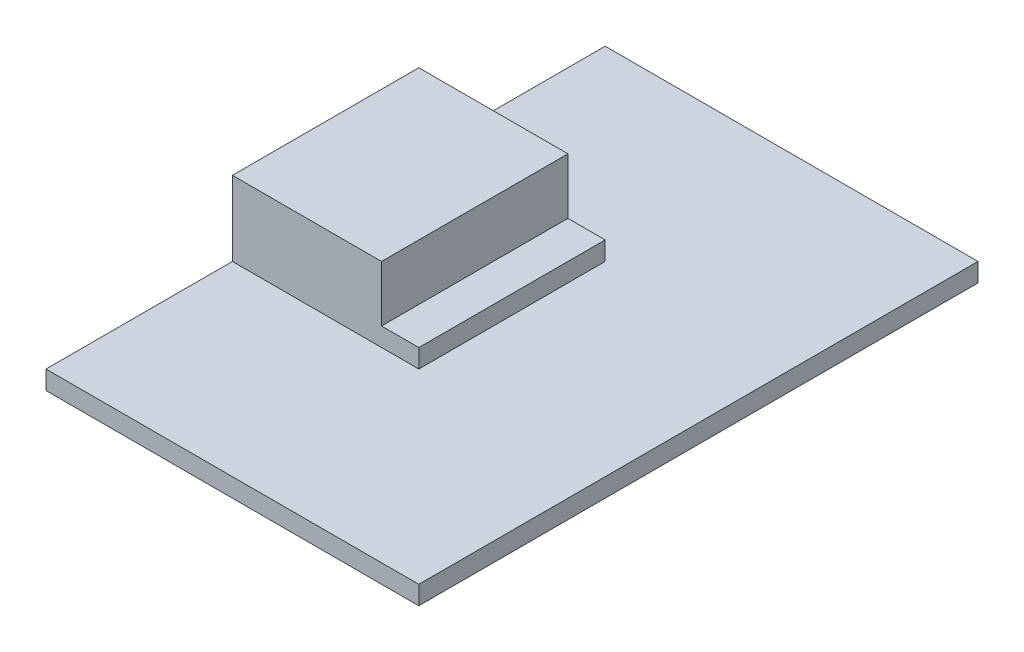
ISO-10303-21;
HEADER;
FILE_DESCRIPTION(('STEP AP214'),'2;1');
FILE_NAME('part.step','',(''),(''),'','','');
FILE_SCHEMA(('AUTOMOTIVE_DESIGN { 1 0 10303 214 1 1 1 1 }'));
ENDSEC;
DATA;
#1=APPLICATION_CONTEXT('core data for automotive mechanical design processes');
#2=APPLICATION_PROTOCOL_DEFINITION('international standard','automotive_design',2000,#1);
#3=PRODUCT_CONTEXT('',#1,'mechanical');
#4=PRODUCT('Part','Part','',(#3));
#5=PRODUCT_RELATED_PRODUCT_CATEGORY('part','',(#4));
#6=PRODUCT_DEFINITION_FORMATION('','',#4);
#7=PRODUCT_DEFINITION_CONTEXT('part definition',#1,'design');
#8=PRODUCT_DEFINITION('design','',#6,#7);
#9=PRODUCT_DEFINITION_SHAPE('','',#8);
#10=(LENGTH_UNIT() NAMED_UNIT(*) SI_UNIT(.MILLI.,.METRE.));
#11=(NAMED_UNIT(*) PLANE_ANGLE_UNIT() SI_UNIT($,.RADIAN.));
#12=(NAMED_UNIT(*) SI_UNIT($,.STERADIAN.) SOLID_ANGLE_UNIT());
#13=UNCERTAINTY_MEASURE_WITH_UNIT(LENGTH_MEASURE(1.E-05),#10,'distance_accuracy_value','');
#14=(GEOMETRIC_REPRESENTATION_CONTEXT(3) GLOBAL_UNCERTAINTY_ASSIGNED_CONTEXT((#13)) GLOBAL_UNIT_ASSIGNED_CONTEXT((#10,
#11,#12)) REPRESENTATION_CONTEXT('',''));
#15=CARTESIAN_POINT('',(0.,0.,0.));
#16=DIRECTION('',(0.,0.,1.));
#17=DIRECTION('',(1.,0.,0.));
#18=AXIS2_PLACEMENT_3D('',#15,#16,#17);
#19=CARTESIAN_POINT('',(4.,5.,5.));
#20=DIRECTION('',(0.,0.,-1.));
#21=DIRECTION('',(-1.,0.,0.));
#22=AXIS2_PLACEMENT_3D('',#19,#20,#21);
#23=PLANE('',#22);
#24=DIRECTION('',(-1.,0.,0.));
#25=VECTOR('',#24,1.);
#26=CARTESIAN_POINT('',(4.,1.,5.));
#27=LINE('',#26,#25);
#28=CARTESIAN_POINT('',(6.,1.,5.));
#29=VERTEX_POINT('',#28);
#30=CARTESIAN_POINT('',(-4.,1.,5.));
#31=VERTEX_POINT('',#30);
#32=EDGE_CURVE('E156',#29,#31,#27,.T.);
#33=ORIENTED_EDGE('',*,*,#32,.F.);
#34=DIRECTION('',(0.,-1.,0.));
#35=VECTOR('',#34,1.);
#36=CARTESIAN_POINT('',(6.,0.,5.));
#37=LINE('',#36,#35);
#38=CARTESIAN_POINT('',(6.,2.,5.));
#39=VERTEX_POINT('',#38);
#40=EDGE_CURVE('E159',#39,#29,#37,.T.);
#41=ORIENTED_EDGE('',*,*,#40,.F.);
#42=DIRECTION('',(-1.,0.,0.));
#43=VECTOR('',#42,1.);
#44=CARTESIAN_POINT('',(6.,2.,5.));
#45=LINE('',#44,#43);
#46=CARTESIAN_POINT('',(4.,2.,5.));
#47=VERTEX_POINT('',#46);
#48=EDGE_CURVE('E166',#39,#47,#45,.T.);
#49=ORIENTED_EDGE('',*,*,#48,.T.);
#50=DIRECTION('',(0.,-1.,0.));
#51=VECTOR('',#50,1.);
#52=CARTESIAN_POINT('',(4.,5.,5.));
#53=LINE('',#52,#51);
#54=CARTESIAN_POINT('',(4.,5.,5.));
#55=VERTEX_POINT('',#54);
#56=EDGE_CURVE('E175',#55,#47,#53,.T.);
#57=ORIENTED_EDGE('',*,*,#56,.F.);
#58=DIRECTION('',(1.,0.,0.));
#59=VECTOR('',#58,1.);
#60=CARTESIAN_POINT('',(4.,5.,5.));
#61=LINE('',#60,#59);
#62=CARTESIAN_POINT('',(-4.,5.,5.));
#63=VERTEX_POINT('',#62);
#64=EDGE_CURVE('E191',#63,#55,#61,.T.);
#65=ORIENTED_EDGE('',*,*,#64,.F.);
#66=DIRECTION('',(0.,-1.,0.));
#67=VECTOR('',#66,1.);
#68=CARTESIAN_POINT('',(-4.,5.,5.));
#69=LINE('',#68,#67);
#70=EDGE_CURVE('E42',#63,#31,#69,.T.);
#71=ORIENTED_EDGE('',*,*,#70,.T.);
#72=EDGE_LOOP('',(#33,#41,#49,#57,#65,#71));
#73=FACE_BOUND('',#72,.T.);
#74=ADVANCED_FACE('F34',(#73),#23,.F.);
#75=CARTESIAN_POINT('',(4.,5.,-5.));
#76=DIRECTION('',(0.,0.,1.));
#77=DIRECTION('',(1.,0.,0.));
#78=AXIS2_PLACEMENT_3D('',#75,#76,#77);
#79=PLANE('',#78);
#80=DIRECTION('',(1.,0.,0.));
#81=VECTOR('',#80,1.);
#82=CARTESIAN_POINT('',(4.,1.,-5.));
#83=LINE('',#82,#81);
#84=CARTESIAN_POINT('',(-4.,1.,-5.));
#85=VERTEX_POINT('',#84);
#86=CARTESIAN_POINT('',(6.,1.,-5.));
#87=VERTEX_POINT('',#86);
#88=EDGE_CURVE('E56',#85,#87,#83,.T.);
#89=ORIENTED_EDGE('',*,*,#88,.F.);
#90=DIRECTION('',(0.,-1.,0.));
#91=VECTOR('',#90,1.);
#92=CARTESIAN_POINT('',(-4.,5.,-5.));
#93=LINE('',#92,#91);
#94=CARTESIAN_POINT('',(-4.,5.,-5.));
#95=VERTEX_POINT('',#94);
#96=EDGE_CURVE('E117',#95,#85,#93,.T.);
#97=ORIENTED_EDGE('',*,*,#96,.F.);
#98=DIRECTION('',(-1.,0.,0.));
#99=VECTOR('',#98,1.);
#100=CARTESIAN_POINT('',(4.,5.,-5.));
#101=LINE('',#100,#99);
#102=CARTESIAN_POINT('',(4.,5.,-5.));
#103=VERTEX_POINT('',#102);
#104=EDGE_CURVE('E194',#103,#95,#101,.T.);
#105=ORIENTED_EDGE('',*,*,#104,.F.);
#106=DIRECTION('',(0.,-1.,0.));
#107=VECTOR('',#106,1.);
#108=CARTESIAN_POINT('',(4.,5.,-5.));
#109=LINE('',#108,#107);
#110=CARTESIAN_POINT('',(4.,2.,-5.));
#111=VERTEX_POINT('',#110);
#112=EDGE_CURVE('E197',#103,#111,#109,.T.);
#113=ORIENTED_EDGE('',*,*,#112,.T.);
#114=DIRECTION('',(-1.,0.,0.));
#115=VECTOR('',#114,1.);
#116=CARTESIAN_POINT('',(6.,2.,-5.));
#117=LINE('',#116,#115);
#118=CARTESIAN_POINT('',(6.,2.,-5.));
#119=VERTEX_POINT('',#118);
#120=EDGE_CURVE('E180',#119,#111,#117,.T.);
#121=ORIENTED_EDGE('',*,*,#120,.F.);
#122=DIRECTION('',(0.,1.,0.));
#123=VECTOR('',#122,1.);
#124=CARTESIAN_POINT('',(6.,0.,-5.));
#125=LINE('',#124,#123);
#126=EDGE_CURVE('E162',#87,#119,#125,.T.);
#127=ORIENTED_EDGE('',*,*,#126,.F.);
#128=EDGE_LOOP('',(#89,#97,#105,#113,#121,#127));
#129=FACE_BOUND('',#128,.T.);
#130=ADVANCED_FACE('F231',(#129),#79,.F.);
#131=CARTESIAN_POINT('',(6.,0.,0.));
#132=DIRECTION('',(-1.,0.,0.));
#133=DIRECTION('',(0.,0.,1.));
#134=AXIS2_PLACEMENT_3D('',#131,#132,#133);
#135=PLANE('',#134);
#136=DIRECTION('',(0.,0.,1.));
#137=VECTOR('',#136,1.);
#138=CARTESIAN_POINT('',(6.,1.,0.));
#139=LINE('',#138,#137);
#140=EDGE_CURVE('E11',#87,#29,#139,.T.);
#141=ORIENTED_EDGE('',*,*,#140,.F.);
#142=ORIENTED_EDGE('',*,*,#126,.T.);
#143=DIRECTION('',(0.,0.,1.));
#144=VECTOR('',#143,1.);
#145=CARTESIAN_POINT('',(6.,2.,5.));
#146=LINE('',#145,#144);
#147=EDGE_CURVE('E164',#119,#39,#146,.T.);
#148=ORIENTED_EDGE('',*,*,#147,.T.);
#149=ORIENTED_EDGE('',*,*,#40,.T.);
#150=EDGE_LOOP('',(#141,#142,#148,#149));
#151=FACE_BOUND('',#150,.T.);
#152=ADVANCED_FACE('F212',(#151),#135,.F.);
#153=CARTESIAN_POINT('',(4.,5.,-5.));
#154=DIRECTION('',(-1.,0.,0.));
#155=DIRECTION('',(0.,0.,1.));
#156=AXIS2_PLACEMENT_3D('',#153,#154,#155);
#157=PLANE('',#156);
#158=DIRECTION('',(0.,0.,1.));
#159=VECTOR('',#158,1.);
#160=CARTESIAN_POINT('',(4.,2.,5.));
#161=LINE('',#160,#159);
#162=EDGE_CURVE('E158',#111,#47,#161,.T.);
#163=ORIENTED_EDGE('',*,*,#162,.F.);
#164=ORIENTED_EDGE('',*,*,#112,.F.);
#165=DIRECTION('',(0.,0.,-1.));
#166=VECTOR('',#165,1.);
#167=CARTESIAN_POINT('',(4.,5.,-5.));
#168=LINE('',#167,#166);
#169=EDGE_CURVE('E207',#55,#103,#168,.T.);
#170=ORIENTED_EDGE('',*,*,#169,.F.);
#171=ORIENTED_EDGE('',*,*,#56,.T.);
#172=EDGE_LOOP('',(#163,#164,#170,#171));
#173=FACE_BOUND('',#172,.T.);
#174=ADVANCED_FACE('F205',(#173),#157,.F.);
#175=CARTESIAN_POINT('',(-4.,5.,-5.));
#176=DIRECTION('',(1.,0.,0.));
#177=DIRECTION('',(0.,0.,-1.));
#178=AXIS2_PLACEMENT_3D('',#175,#176,#177);
#179=PLANE('',#178);
#180=DIRECTION('',(0.,0.,1.));
#181=VECTOR('',#180,1.);
#182=CARTESIAN_POINT('',(-4.,0.,-5.));
#183=LINE('',#182,#181);
#184=CARTESIAN_POINT('',(-4.,0.,-15.));
#185=VERTEX_POINT('',#184);
#186=CARTESIAN_POINT('',(-4.,0.,15.));
#187=VERTEX_POINT('',#186);
#188=EDGE_CURVE('E184',#185,#187,#183,.T.);
#189=ORIENTED_EDGE('',*,*,#188,.T.);
#190=DIRECTION('',(0.,-1.,0.));
#191=VECTOR('',#190,1.);
#192=CARTESIAN_POINT('',(-4.,1.,15.));
#193=LINE('',#192,#191);
#194=CARTESIAN_POINT('',(-4.,1.,15.));
#195=VERTEX_POINT('',#194);
#196=EDGE_CURVE('E149',#195,#187,#193,.T.);
#197=ORIENTED_EDGE('',*,*,#196,.F.);
#198=DIRECTION('',(0.,0.,-1.));
#199=VECTOR('',#198,1.);
#200=CARTESIAN_POINT('',(-4.,1.,15.));
#201=LINE('',#200,#199);
#202=EDGE_CURVE('E120',#195,#31,#201,.T.);
#203=ORIENTED_EDGE('',*,*,#202,.T.);
#204=ORIENTED_EDGE('',*,*,#70,.F.);
#205=DIRECTION('',(0.,0.,1.));
#206=VECTOR('',#205,1.);
#207=CARTESIAN_POINT('',(-4.,5.,-5.));
#208=LINE('',#207,#206);
#209=EDGE_CURVE('E169',#95,#63,#208,.T.);
#210=ORIENTED_EDGE('',*,*,#209,.F.);
#211=ORIENTED_EDGE('',*,*,#96,.T.);
#212=CARTESIAN_POINT('',(-4.,1.,-15.));
#213=VERTEX_POINT('',#212);
#214=EDGE_CURVE('E112',#85,#213,#201,.T.);
#215=ORIENTED_EDGE('',*,*,#214,.T.);
#216=DIRECTION('',(0.,-1.,0.));
#217=VECTOR('',#216,1.);
#218=CARTESIAN_POINT('',(-4.,1.,-15.));
#219=LINE('',#218,#217);
#220=EDGE_CURVE('E114',#213,#185,#219,.T.);
#221=ORIENTED_EDGE('',*,*,#220,.T.);
#222=EDGE_LOOP('',(#189,#197,#203,#204,#210,#211,#215,#221));
#223=FACE_BOUND('',#222,.T.);
#224=ADVANCED_FACE('F36',(#223),#179,.F.);
#225=CARTESIAN_POINT('',(0.,5.,0.));
#226=DIRECTION('',(0.,-1.,0.));
#227=DIRECTION('',(0.,0.,-1.));
#228=AXIS2_PLACEMENT_3D('',#225,#226,#227);
#229=PLANE('',#228);
#230=ORIENTED_EDGE('',*,*,#209,.T.);
#231=ORIENTED_EDGE('',*,*,#64,.T.);
#232=ORIENTED_EDGE('',*,*,#169,.T.);
#233=ORIENTED_EDGE('',*,*,#104,.T.);
#234=EDGE_LOOP('',(#230,#231,#232,#233));
#235=FACE_BOUND('',#234,.T.);
#236=ADVANCED_FACE('F241',(#235),#229,.F.);
#237=CARTESIAN_POINT('',(0.,0.,0.));
#238=DIRECTION('',(0.,-1.,0.));
#239=DIRECTION('',(0.,0.,-1.));
#240=AXIS2_PLACEMENT_3D('',#237,#238,#239);
#241=PLANE('',#240);
#242=ORIENTED_EDGE('',*,*,#188,.F.);
#243=DIRECTION('',(1.,0.,0.));
#244=VECTOR('',#243,1.);
#245=CARTESIAN_POINT('',(-4.,0.,-15.));
#246=LINE('',#245,#244);
#247=CARTESIAN_POINT('',(16.,0.,-15.));
#248=VERTEX_POINT('',#247);
#249=EDGE_CURVE('E128',#185,#248,#246,.T.);
#250=ORIENTED_EDGE('',*,*,#249,.T.);
#251=DIRECTION('',(0.,0.,1.));
#252=VECTOR('',#251,1.);
#253=CARTESIAN_POINT('',(16.,0.,15.));
#254=LINE('',#253,#252);
#255=CARTESIAN_POINT('',(16.,0.,15.));
#256=VERTEX_POINT('',#255);
#257=EDGE_CURVE('E144',#248,#256,#254,.T.);
#258=ORIENTED_EDGE('',*,*,#257,.T.);
#259=DIRECTION('',(-1.,0.,0.));
#260=VECTOR('',#259,1.);
#261=CARTESIAN_POINT('',(-4.,0.,15.));
#262=LINE('',#261,#260);
#263=EDGE_CURVE('E121',#256,#187,#262,.T.);
#264=ORIENTED_EDGE('',*,*,#263,.T.);
#265=EDGE_LOOP('',(#242,#250,#258,#264));
#266=FACE_BOUND('',#265,.T.);
#267=ADVANCED_FACE('F218',(#266),#241,.T.);
#268=CARTESIAN_POINT('',(6.,2.,5.));
#269=DIRECTION('',(0.,-1.,0.));
#270=DIRECTION('',(0.,0.,-1.));
#271=AXIS2_PLACEMENT_3D('',#268,#269,#270);
#272=PLANE('',#271);
#273=ORIENTED_EDGE('',*,*,#162,.T.);
#274=ORIENTED_EDGE('',*,*,#48,.F.);
#275=ORIENTED_EDGE('',*,*,#147,.F.);
#276=ORIENTED_EDGE('',*,*,#120,.T.);
#277=EDGE_LOOP('',(#273,#274,#275,#276));
#278=FACE_BOUND('',#277,.T.);
#279=ADVANCED_FACE('F209',(#278),#272,.F.);
#280=CARTESIAN_POINT('',(0.,1.,0.));
#281=DIRECTION('',(0.,-1.,0.));
#282=DIRECTION('',(0.,0.,-1.));
#283=AXIS2_PLACEMENT_3D('',#280,#281,#282);
#284=PLANE('',#283);
#285=ORIENTED_EDGE('',*,*,#140,.T.);
#286=ORIENTED_EDGE('',*,*,#32,.T.);
#287=ORIENTED_EDGE('',*,*,#202,.F.);
#288=DIRECTION('',(-1.,0.,0.));
#289=VECTOR('',#288,1.);
#290=CARTESIAN_POINT('',(-4.,1.,15.));
#291=LINE('',#290,#289);
#292=CARTESIAN_POINT('',(16.,1.,15.));
#293=VERTEX_POINT('',#292);
#294=EDGE_CURVE('E130',#293,#195,#291,.T.);
#295=ORIENTED_EDGE('',*,*,#294,.F.);
#296=DIRECTION('',(0.,0.,1.));
#297=VECTOR('',#296,1.);
#298=CARTESIAN_POINT('',(16.,1.,15.));
#299=LINE('',#298,#297);
#300=CARTESIAN_POINT('',(16.,1.,-15.));
#301=VERTEX_POINT('',#300);
#302=EDGE_CURVE('E136',#301,#293,#299,.T.);
#303=ORIENTED_EDGE('',*,*,#302,.F.);
#304=DIRECTION('',(1.,0.,0.));
#305=VECTOR('',#304,1.);
#306=CARTESIAN_POINT('',(-4.,1.,-15.));
#307=LINE('',#306,#305);
#308=EDGE_CURVE('E126',#213,#301,#307,.T.);
#309=ORIENTED_EDGE('',*,*,#308,.F.);
#310=ORIENTED_EDGE('',*,*,#214,.F.);
#311=ORIENTED_EDGE('',*,*,#88,.T.);
#312=EDGE_LOOP('',(#285,#286,#287,#295,#303,#309,#310,#311));
#313=FACE_BOUND('',#312,.T.);
#314=ADVANCED_FACE('F133',(#313),#284,.F.);
#315=CARTESIAN_POINT('',(-4.,1.,15.));
#316=DIRECTION('',(0.,0.,1.));
#317=DIRECTION('',(1.,0.,0.));
#318=AXIS2_PLACEMENT_3D('',#315,#316,#317);
#319=PLANE('',#318);
#320=ORIENTED_EDGE('',*,*,#263,.F.);
#321=DIRECTION('',(0.,-1.,0.));
#322=VECTOR('',#321,1.);
#323=CARTESIAN_POINT('',(16.,1.,15.));
#324=LINE('',#323,#322);
#325=EDGE_CURVE('E152',#293,#256,#324,.T.);
#326=ORIENTED_EDGE('',*,*,#325,.F.);
#327=ORIENTED_EDGE('',*,*,#294,.T.);
#328=ORIENTED_EDGE('',*,*,#196,.T.);
#329=EDGE_LOOP('',(#320,#326,#327,#328));
#330=FACE_BOUND('',#329,.T.);
#331=ADVANCED_FACE('F216',(#330),#319,.T.);
#332=CARTESIAN_POINT('',(16.,1.,15.));
#333=DIRECTION('',(1.,0.,0.));
#334=DIRECTION('',(0.,0.,-1.));
#335=AXIS2_PLACEMENT_3D('',#332,#333,#334);
#336=PLANE('',#335);
#337=ORIENTED_EDGE('',*,*,#257,.F.);
#338=DIRECTION('',(0.,-1.,0.));
#339=VECTOR('',#338,1.);
#340=CARTESIAN_POINT('',(16.,1.,-15.));
#341=LINE('',#340,#339);
#342=EDGE_CURVE('E129',#301,#248,#341,.T.);
#343=ORIENTED_EDGE('',*,*,#342,.F.);
#344=ORIENTED_EDGE('',*,*,#302,.T.);
#345=ORIENTED_EDGE('',*,*,#325,.T.);
#346=EDGE_LOOP('',(#337,#343,#344,#345));
#347=FACE_BOUND('',#346,.T.);
#348=ADVANCED_FACE('F221',(#347),#336,.T.);
#349=CARTESIAN_POINT('',(-4.,1.,-15.));
#350=DIRECTION('',(0.,0.,-1.));
#351=DIRECTION('',(-1.,0.,0.));
#352=AXIS2_PLACEMENT_3D('',#349,#350,#351);
#353=PLANE('',#352);
#354=ORIENTED_EDGE('',*,*,#249,.F.);
#355=ORIENTED_EDGE('',*,*,#220,.F.);
#356=ORIENTED_EDGE('',*,*,#308,.T.);
#357=ORIENTED_EDGE('',*,*,#342,.T.);
#358=EDGE_LOOP('',(#354,#355,#356,#357));
#359=FACE_BOUND('',#358,.T.);
#360=ADVANCED_FACE('F125',(#359),#353,.T.);
#361=CLOSED_SHELL('',(#74,#130,#152,#174,#224,#236,#267,#279,#314,#331,#348,#360));
#362=MANIFOLD_SOLID_BREP('B2',#361);
#363=ADVANCED_BREP_SHAPE_REPRESENTATION('',(#18,#362),#14);
#364=SHAPE_DEFINITION_REPRESENTATION(#9,#363);
ENDSEC;
END-ISO-10303-21;
